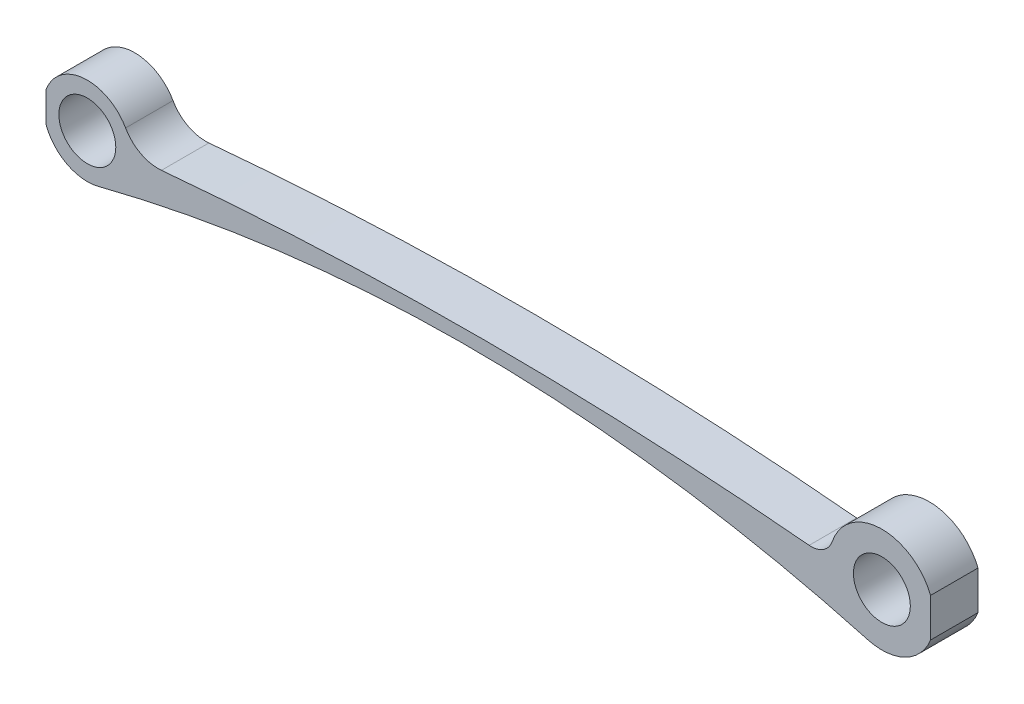
ISO-10303-21;
HEADER;
FILE_DESCRIPTION(('STEP AP214'),'2;1');
FILE_NAME('part.step','',(''),(''),'','','');
FILE_SCHEMA(('AUTOMOTIVE_DESIGN { 1 0 10303 214 1 1 1 1 }'));
ENDSEC;
DATA;
#1=APPLICATION_CONTEXT('core data for automotive mechanical design processes');
#2=APPLICATION_PROTOCOL_DEFINITION('international standard','automotive_design',2000,#1);
#3=PRODUCT_CONTEXT('',#1,'mechanical');
#4=PRODUCT('Part','Part','',(#3));
#5=PRODUCT_RELATED_PRODUCT_CATEGORY('part','',(#4));
#6=PRODUCT_DEFINITION_FORMATION('','',#4);
#7=PRODUCT_DEFINITION_CONTEXT('part definition',#1,'design');
#8=PRODUCT_DEFINITION('design','',#6,#7);
#9=PRODUCT_DEFINITION_SHAPE('','',#8);
#10=(LENGTH_UNIT() NAMED_UNIT(*) SI_UNIT(.MILLI.,.METRE.));
#11=(NAMED_UNIT(*) PLANE_ANGLE_UNIT() SI_UNIT($,.RADIAN.));
#12=(NAMED_UNIT(*) SI_UNIT($,.STERADIAN.) SOLID_ANGLE_UNIT());
#13=UNCERTAINTY_MEASURE_WITH_UNIT(LENGTH_MEASURE(1.E-05),#10,'distance_accuracy_value','');
#14=(GEOMETRIC_REPRESENTATION_CONTEXT(3) GLOBAL_UNCERTAINTY_ASSIGNED_CONTEXT((#13)) GLOBAL_UNIT_ASSIGNED_CONTEXT((#10,
#11,#12)) REPRESENTATION_CONTEXT('',''));
#15=CARTESIAN_POINT('',(0.,0.,0.));
#16=DIRECTION('',(0.,0.,1.));
#17=DIRECTION('',(1.,0.,0.));
#18=AXIS2_PLACEMENT_3D('',#15,#16,#17);
#19=CARTESIAN_POINT('',(20.0774393372365,-78.7302661466852,5.));
#20=DIRECTION('',(0.,0.,1.));
#21=DIRECTION('',(1.,0.,0.));
#22=AXIS2_PLACEMENT_3D('',#19,#20,#21);
#23=PLANE('',#22);
#24=CARTESIAN_POINT('',(0.,0.,5.));
#25=DIRECTION('',(0.,0.,1.));
#26=DIRECTION('',(1.,0.,0.));
#27=AXIS2_PLACEMENT_3D('',#24,#25,#26);
#28=CIRCLE('',#27,3.00000007924961);
#29=CARTESIAN_POINT('',(3.00000007924961,0.,5.));
#30=VERTEX_POINT('',#29);
#31=EDGE_CURVE('E179',#30,#30,#28,.T.);
#32=ORIENTED_EDGE('',*,*,#31,.F.);
#33=EDGE_LOOP('',(#32));
#34=FACE_BOUND('',#33,.T.);
#35=CARTESIAN_POINT('',(83.76241555,0.,5.));
#36=DIRECTION('',(0.,0.,1.));
#37=DIRECTION('',(1.,0.,0.));
#38=AXIS2_PLACEMENT_3D('',#35,#36,#37);
#39=CIRCLE('',#38,3.00000007924962);
#40=CARTESIAN_POINT('',(86.7624156292496,0.,5.));
#41=VERTEX_POINT('',#40);
#42=EDGE_CURVE('E209',#41,#41,#39,.T.);
#43=ORIENTED_EDGE('',*,*,#42,.F.);
#44=EDGE_LOOP('',(#43));
#45=FACE_BOUND('',#44,.T.);
#46=CARTESIAN_POINT('',(0.,0.,5.));
#47=DIRECTION('',(0.,0.,1.));
#48=DIRECTION('',(1.,0.,0.));
#49=AXIS2_PLACEMENT_3D('',#46,#47,#48);
#50=CIRCLE('',#49,4.63518821296482);
#51=CARTESIAN_POINT('',(4.03391514535895,2.28308965431751,5.));
#52=VERTEX_POINT('',#51);
#53=CARTESIAN_POINT('',(-4.35681947691644,1.58211687784739,5.));
#54=VERTEX_POINT('',#53);
#55=EDGE_CURVE('E144',#52,#54,#50,.T.);
#56=ORIENTED_EDGE('',*,*,#55,.T.);
#57=DIRECTION('',(0.,1.,0.));
#58=VECTOR('',#57,1.);
#59=CARTESIAN_POINT('',(-4.35681947691644,0.,5.));
#60=LINE('',#59,#58);
#61=CARTESIAN_POINT('',(-4.35681947691644,-1.58211687784739,5.));
#62=VERTEX_POINT('',#61);
#63=EDGE_CURVE('E114',#62,#54,#60,.T.);
#64=ORIENTED_EDGE('',*,*,#63,.F.);
#65=CARTESIAN_POINT('',(1.14538755959981,-4.49144265330439,5.));
#66=VERTEX_POINT('',#65);
#67=EDGE_CURVE('E164',#62,#66,#50,.T.);
#68=ORIENTED_EDGE('',*,*,#67,.T.);
#69=CARTESIAN_POINT('',(40.1548786744729,-157.46053229337,5.));
#70=DIRECTION('',(0.,0.,-1.));
#71=DIRECTION('',(1.,0.,0.));
#72=AXIS2_PLACEMENT_3D('',#69,#70,#71);
#73=CIRCLE('',#72,157.864761053099);
#74=CARTESIAN_POINT('',(82.2884468660165,-5.32228853526576,5.));
#75=VERTEX_POINT('',#74);
#76=EDGE_CURVE('E132',#66,#75,#73,.T.);
#77=ORIENTED_EDGE('',*,*,#76,.T.);
#78=CARTESIAN_POINT('',(83.76241555,0.,5.));
#79=DIRECTION('',(0.,0.,1.));
#80=DIRECTION('',(1.,0.,0.));
#81=AXIS2_PLACEMENT_3D('',#78,#79,#80);
#82=CIRCLE('',#81,5.5226206581645);
#83=CARTESIAN_POINT('',(88.8955383003181,-2.03725054034898,5.));
#84=VERTEX_POINT('',#83);
#85=EDGE_CURVE('E201',#75,#84,#82,.T.);
#86=ORIENTED_EDGE('',*,*,#85,.T.);
#87=DIRECTION('',(0.,-1.,0.));
#88=VECTOR('',#87,1.);
#89=CARTESIAN_POINT('',(88.8955383003181,0.,5.));
#90=LINE('',#89,#88);
#91=CARTESIAN_POINT('',(88.8955383003181,2.03725054034898,5.));
#92=VERTEX_POINT('',#91);
#93=EDGE_CURVE('E215',#92,#84,#90,.T.);
#94=ORIENTED_EDGE('',*,*,#93,.F.);
#95=CARTESIAN_POINT('',(78.537310201847,1.78818708045004,5.));
#96=VERTEX_POINT('',#95);
#97=EDGE_CURVE('E135',#92,#96,#82,.T.);
#98=ORIENTED_EDGE('',*,*,#97,.T.);
#99=CARTESIAN_POINT('',(76.3123699186025,2.54962808578346,5.));
#100=DIRECTION('',(0.,0.,-1.));
#101=DIRECTION('',(1.,0.,0.));
#102=AXIS2_PLACEMENT_3D('',#99,#100,#101);
#103=CIRCLE('',#102,2.35162745106599);
#104=CARTESIAN_POINT('',(76.0921387205939,0.208335731541776,5.));
#105=VERTEX_POINT('',#104);
#106=EDGE_CURVE('E200',#96,#105,#103,.T.);
#107=ORIENTED_EDGE('',*,*,#106,.T.);
#108=CARTESIAN_POINT('',(41.4374915524002,-368.207498117251,5.));
#109=DIRECTION('',(0.,0.,1.));
#110=DIRECTION('',(1.,0.,0.));
#111=AXIS2_PLACEMENT_3D('',#108,#109,#110);
#112=CIRCLE('',#111,370.042120846875);
#113=CARTESIAN_POINT('',(7.81361057668051,0.303839332472362,5.));
#114=VERTEX_POINT('',#113);
#115=EDGE_CURVE('E171',#105,#114,#112,.T.);
#116=ORIENTED_EDGE('',*,*,#115,.T.);
#117=CARTESIAN_POINT('',(7.45628490178643,4.22006073640343,5.));
#118=DIRECTION('',(0.,0.,-1.));
#119=DIRECTION('',(1.,0.,0.));
#120=AXIS2_PLACEMENT_3D('',#117,#118,#119);
#121=CIRCLE('',#120,3.93248925269305);
#122=EDGE_CURVE('E169',#114,#52,#121,.T.);
#123=ORIENTED_EDGE('',*,*,#122,.T.);
#124=EDGE_LOOP('',(#56,#64,#68,#77,#86,#94,#98,#107,#116,#123));
#125=FACE_BOUND('',#124,.T.);
#126=ADVANCED_FACE('F38',(#34,#45,#125),#23,.T.);
#127=CARTESIAN_POINT('',(20.0774393372365,-78.7302661466852,0.));
#128=DIRECTION('',(0.,0.,1.));
#129=DIRECTION('',(1.,0.,0.));
#130=AXIS2_PLACEMENT_3D('',#127,#128,#129);
#131=PLANE('',#130);
#132=CARTESIAN_POINT('',(0.,0.,0.));
#133=DIRECTION('',(0.,0.,1.));
#134=DIRECTION('',(1.,0.,0.));
#135=AXIS2_PLACEMENT_3D('',#132,#133,#134);
#136=CIRCLE('',#135,3.00000007924961);
#137=CARTESIAN_POINT('',(3.00000007924961,0.,0.));
#138=VERTEX_POINT('',#137);
#139=EDGE_CURVE('E206',#138,#138,#136,.T.);
#140=ORIENTED_EDGE('',*,*,#139,.T.);
#141=EDGE_LOOP('',(#140));
#142=FACE_BOUND('',#141,.T.);
#143=CARTESIAN_POINT('',(83.76241555,0.,0.));
#144=DIRECTION('',(0.,0.,1.));
#145=DIRECTION('',(1.,0.,0.));
#146=AXIS2_PLACEMENT_3D('',#143,#144,#145);
#147=CIRCLE('',#146,3.00000007924962);
#148=CARTESIAN_POINT('',(86.7624156292496,0.,0.));
#149=VERTEX_POINT('',#148);
#150=EDGE_CURVE('E212',#149,#149,#147,.T.);
#151=ORIENTED_EDGE('',*,*,#150,.T.);
#152=EDGE_LOOP('',(#151));
#153=FACE_BOUND('',#152,.T.);
#154=DIRECTION('',(0.,1.,0.));
#155=VECTOR('',#154,1.);
#156=CARTESIAN_POINT('',(-4.35681947691644,0.,0.));
#157=LINE('',#156,#155);
#158=CARTESIAN_POINT('',(-4.35681947691644,-1.58211687784739,0.));
#159=VERTEX_POINT('',#158);
#160=CARTESIAN_POINT('',(-4.35681947691644,1.58211687784739,0.));
#161=VERTEX_POINT('',#160);
#162=EDGE_CURVE('E52',#159,#161,#157,.T.);
#163=ORIENTED_EDGE('',*,*,#162,.T.);
#164=CARTESIAN_POINT('',(0.,0.,0.));
#165=DIRECTION('',(0.,0.,1.));
#166=DIRECTION('',(1.,0.,0.));
#167=AXIS2_PLACEMENT_3D('',#164,#165,#166);
#168=CIRCLE('',#167,4.63518821296482);
#169=CARTESIAN_POINT('',(4.03391514535895,2.28308965431751,0.));
#170=VERTEX_POINT('',#169);
#171=EDGE_CURVE('E124',#170,#161,#168,.T.);
#172=ORIENTED_EDGE('',*,*,#171,.F.);
#173=CARTESIAN_POINT('',(7.45628490178643,4.22006073640343,0.));
#174=DIRECTION('',(0.,0.,-1.));
#175=DIRECTION('',(1.,0.,0.));
#176=AXIS2_PLACEMENT_3D('',#173,#174,#175);
#177=CIRCLE('',#176,3.93248925269305);
#178=CARTESIAN_POINT('',(7.81361057668051,0.303839332472362,0.));
#179=VERTEX_POINT('',#178);
#180=EDGE_CURVE('E137',#179,#170,#177,.T.);
#181=ORIENTED_EDGE('',*,*,#180,.F.);
#182=CARTESIAN_POINT('',(41.4374915524002,-368.207498117251,0.));
#183=DIRECTION('',(0.,0.,1.));
#184=DIRECTION('',(1.,0.,0.));
#185=AXIS2_PLACEMENT_3D('',#182,#183,#184);
#186=CIRCLE('',#185,370.042120846875);
#187=CARTESIAN_POINT('',(76.0921387205939,0.208335731541776,0.));
#188=VERTEX_POINT('',#187);
#189=EDGE_CURVE('E184',#188,#179,#186,.T.);
#190=ORIENTED_EDGE('',*,*,#189,.F.);
#191=CARTESIAN_POINT('',(76.3123699186025,2.54962808578346,0.));
#192=DIRECTION('',(0.,0.,-1.));
#193=DIRECTION('',(1.,0.,0.));
#194=AXIS2_PLACEMENT_3D('',#191,#192,#193);
#195=CIRCLE('',#194,2.35162745106599);
#196=CARTESIAN_POINT('',(78.537310201847,1.78818708045004,0.));
#197=VERTEX_POINT('',#196);
#198=EDGE_CURVE('E183',#197,#188,#195,.T.);
#199=ORIENTED_EDGE('',*,*,#198,.F.);
#200=CARTESIAN_POINT('',(83.76241555,0.,0.));
#201=DIRECTION('',(0.,0.,1.));
#202=DIRECTION('',(1.,0.,0.));
#203=AXIS2_PLACEMENT_3D('',#200,#201,#202);
#204=CIRCLE('',#203,5.5226206581645);
#205=CARTESIAN_POINT('',(88.8955383003181,2.03725054034898,0.));
#206=VERTEX_POINT('',#205);
#207=EDGE_CURVE('E178',#206,#197,#204,.T.);
#208=ORIENTED_EDGE('',*,*,#207,.F.);
#209=DIRECTION('',(0.,-1.,0.));
#210=VECTOR('',#209,1.);
#211=CARTESIAN_POINT('',(88.8955383003181,0.,0.));
#212=LINE('',#211,#210);
#213=CARTESIAN_POINT('',(88.8955383003181,-2.03725054034898,0.));
#214=VERTEX_POINT('',#213);
#215=EDGE_CURVE('E60',#206,#214,#212,.T.);
#216=ORIENTED_EDGE('',*,*,#215,.T.);
#217=CARTESIAN_POINT('',(82.2884468660165,-5.32228853526576,0.));
#218=VERTEX_POINT('',#217);
#219=EDGE_CURVE('E180',#218,#214,#204,.T.);
#220=ORIENTED_EDGE('',*,*,#219,.F.);
#221=CARTESIAN_POINT('',(40.1548786744729,-157.46053229337,0.));
#222=DIRECTION('',(0.,0.,-1.));
#223=DIRECTION('',(1.,0.,0.));
#224=AXIS2_PLACEMENT_3D('',#221,#222,#223);
#225=CIRCLE('',#224,157.864761053099);
#226=CARTESIAN_POINT('',(1.14538755959981,-4.49144265330439,0.));
#227=VERTEX_POINT('',#226);
#228=EDGE_CURVE('E175',#227,#218,#225,.T.);
#229=ORIENTED_EDGE('',*,*,#228,.F.);
#230=EDGE_CURVE('E126',#159,#227,#168,.T.);
#231=ORIENTED_EDGE('',*,*,#230,.F.);
#232=EDGE_LOOP('',(#163,#172,#181,#190,#199,#208,#216,#220,#229,#231));
#233=FACE_BOUND('',#232,.T.);
#234=ADVANCED_FACE('F122',(#142,#153,#233),#131,.F.);
#235=CARTESIAN_POINT('',(0.,0.,5.));
#236=DIRECTION('',(0.,0.,-1.));
#237=DIRECTION('',(-1.,0.,0.));
#238=AXIS2_PLACEMENT_3D('',#235,#236,#237);
#239=CYLINDRICAL_SURFACE('',#238,4.63518821296482);
#240=DIRECTION('',(0.,0.,-1.));
#241=VECTOR('',#240,1.);
#242=CARTESIAN_POINT('',(-4.35681947691644,1.58211687784739,5.));
#243=LINE('',#242,#241);
#244=EDGE_CURVE('E11',#54,#161,#243,.T.);
#245=ORIENTED_EDGE('',*,*,#244,.F.);
#246=ORIENTED_EDGE('',*,*,#55,.F.);
#247=DIRECTION('',(0.,0.,-1.));
#248=VECTOR('',#247,1.);
#249=CARTESIAN_POINT('',(4.03391514535895,2.28308965431751,5.));
#250=LINE('',#249,#248);
#251=EDGE_CURVE('E131',#52,#170,#250,.T.);
#252=ORIENTED_EDGE('',*,*,#251,.T.);
#253=ORIENTED_EDGE('',*,*,#171,.T.);
#254=EDGE_LOOP('',(#245,#246,#252,#253));
#255=FACE_BOUND('',#254,.T.);
#256=ADVANCED_FACE('F129',(#255),#239,.T.);
#257=DIRECTION('',(0.,0.,-1.));
#258=VECTOR('',#257,1.);
#259=CARTESIAN_POINT('',(-4.35681947691644,-1.58211687784739,5.));
#260=LINE('',#259,#258);
#261=EDGE_CURVE('E46',#159,#62,#260,.F.);
#262=ORIENTED_EDGE('',*,*,#261,.F.);
#263=ORIENTED_EDGE('',*,*,#230,.T.);
#264=DIRECTION('',(0.,0.,-1.));
#265=VECTOR('',#264,1.);
#266=CARTESIAN_POINT('',(1.14538755959981,-4.49144265330439,5.));
#267=LINE('',#266,#265);
#268=EDGE_CURVE('E141',#66,#227,#267,.T.);
#269=ORIENTED_EDGE('',*,*,#268,.F.);
#270=ORIENTED_EDGE('',*,*,#67,.F.);
#271=EDGE_LOOP('',(#262,#263,#269,#270));
#272=FACE_BOUND('',#271,.T.);
#273=ADVANCED_FACE('F167',(#272),#239,.T.);
#274=CARTESIAN_POINT('',(83.76241555,0.,5.));
#275=DIRECTION('',(0.,0.,-1.));
#276=DIRECTION('',(-1.,0.,0.));
#277=AXIS2_PLACEMENT_3D('',#274,#275,#276);
#278=CYLINDRICAL_SURFACE('',#277,5.5226206581645);
#279=DIRECTION('',(0.,0.,-1.));
#280=VECTOR('',#279,1.);
#281=CARTESIAN_POINT('',(88.8955383003181,-2.03725054034898,5.));
#282=LINE('',#281,#280);
#283=EDGE_CURVE('E160',#84,#214,#282,.T.);
#284=ORIENTED_EDGE('',*,*,#283,.F.);
#285=ORIENTED_EDGE('',*,*,#85,.F.);
#286=DIRECTION('',(0.,0.,-1.));
#287=VECTOR('',#286,1.);
#288=CARTESIAN_POINT('',(82.2884468660165,-5.32228853526576,5.));
#289=LINE('',#288,#287);
#290=EDGE_CURVE('E155',#75,#218,#289,.T.);
#291=ORIENTED_EDGE('',*,*,#290,.T.);
#292=ORIENTED_EDGE('',*,*,#219,.T.);
#293=EDGE_LOOP('',(#284,#285,#291,#292));
#294=FACE_BOUND('',#293,.T.);
#295=ADVANCED_FACE('F224',(#294),#278,.T.);
#296=DIRECTION('',(0.,0.,-1.));
#297=VECTOR('',#296,1.);
#298=CARTESIAN_POINT('',(88.8955383003181,2.03725054034898,5.));
#299=LINE('',#298,#297);
#300=EDGE_CURVE('E158',#206,#92,#299,.F.);
#301=ORIENTED_EDGE('',*,*,#300,.F.);
#302=ORIENTED_EDGE('',*,*,#207,.T.);
#303=DIRECTION('',(0.,0.,-1.));
#304=VECTOR('',#303,1.);
#305=CARTESIAN_POINT('',(78.537310201847,1.78818708045004,5.));
#306=LINE('',#305,#304);
#307=EDGE_CURVE('E152',#96,#197,#306,.T.);
#308=ORIENTED_EDGE('',*,*,#307,.F.);
#309=ORIENTED_EDGE('',*,*,#97,.F.);
#310=EDGE_LOOP('',(#301,#302,#308,#309));
#311=FACE_BOUND('',#310,.T.);
#312=ADVANCED_FACE('F228',(#311),#278,.T.);
#313=CARTESIAN_POINT('',(40.1548786744729,-157.46053229337,5.));
#314=DIRECTION('',(0.,0.,-1.));
#315=DIRECTION('',(-1.,0.,0.));
#316=AXIS2_PLACEMENT_3D('',#313,#314,#315);
#317=CYLINDRICAL_SURFACE('',#316,157.864761053099);
#318=ORIENTED_EDGE('',*,*,#228,.T.);
#319=ORIENTED_EDGE('',*,*,#290,.F.);
#320=ORIENTED_EDGE('',*,*,#76,.F.);
#321=ORIENTED_EDGE('',*,*,#268,.T.);
#322=EDGE_LOOP('',(#318,#319,#320,#321));
#323=FACE_BOUND('',#322,.T.);
#324=ADVANCED_FACE('F40',(#323),#317,.F.);
#325=CARTESIAN_POINT('',(76.3123699186025,2.54962808578346,5.));
#326=DIRECTION('',(0.,0.,-1.));
#327=DIRECTION('',(-1.,0.,0.));
#328=AXIS2_PLACEMENT_3D('',#325,#326,#327);
#329=CYLINDRICAL_SURFACE('',#328,2.35162745106599);
#330=ORIENTED_EDGE('',*,*,#198,.T.);
#331=DIRECTION('',(0.,0.,-1.));
#332=VECTOR('',#331,1.);
#333=CARTESIAN_POINT('',(76.0921387205939,0.208335731541776,5.));
#334=LINE('',#333,#332);
#335=EDGE_CURVE('E149',#105,#188,#334,.T.);
#336=ORIENTED_EDGE('',*,*,#335,.F.);
#337=ORIENTED_EDGE('',*,*,#106,.F.);
#338=ORIENTED_EDGE('',*,*,#307,.T.);
#339=EDGE_LOOP('',(#330,#336,#337,#338));
#340=FACE_BOUND('',#339,.T.);
#341=ADVANCED_FACE('F195',(#340),#329,.F.);
#342=CARTESIAN_POINT('',(41.4374915524002,-368.207498117251,5.));
#343=DIRECTION('',(0.,0.,-1.));
#344=DIRECTION('',(-1.,0.,0.));
#345=AXIS2_PLACEMENT_3D('',#342,#343,#344);
#346=CYLINDRICAL_SURFACE('',#345,370.042120846875);
#347=ORIENTED_EDGE('',*,*,#189,.T.);
#348=DIRECTION('',(0.,0.,-1.));
#349=VECTOR('',#348,1.);
#350=CARTESIAN_POINT('',(7.81361057668051,0.303839332472362,5.));
#351=LINE('',#350,#349);
#352=EDGE_CURVE('E146',#114,#179,#351,.T.);
#353=ORIENTED_EDGE('',*,*,#352,.F.);
#354=ORIENTED_EDGE('',*,*,#115,.F.);
#355=ORIENTED_EDGE('',*,*,#335,.T.);
#356=EDGE_LOOP('',(#347,#353,#354,#355));
#357=FACE_BOUND('',#356,.T.);
#358=ADVANCED_FACE('F199',(#357),#346,.T.);
#359=CARTESIAN_POINT('',(7.45628490178643,4.22006073640343,5.));
#360=DIRECTION('',(0.,0.,-1.));
#361=DIRECTION('',(-1.,0.,0.));
#362=AXIS2_PLACEMENT_3D('',#359,#360,#361);
#363=CYLINDRICAL_SURFACE('',#362,3.93248925269305);
#364=ORIENTED_EDGE('',*,*,#180,.T.);
#365=ORIENTED_EDGE('',*,*,#251,.F.);
#366=ORIENTED_EDGE('',*,*,#122,.F.);
#367=ORIENTED_EDGE('',*,*,#352,.T.);
#368=EDGE_LOOP('',(#364,#365,#366,#367));
#369=FACE_BOUND('',#368,.T.);
#370=ADVANCED_FACE('F189',(#369),#363,.F.);
#371=CARTESIAN_POINT('',(0.,0.,5.));
#372=DIRECTION('',(0.,0.,-1.));
#373=DIRECTION('',(-1.,0.,0.));
#374=AXIS2_PLACEMENT_3D('',#371,#372,#373);
#375=CYLINDRICAL_SURFACE('',#374,3.00000007924961);
#376=ORIENTED_EDGE('',*,*,#31,.T.);
#377=EDGE_LOOP('',(#376));
#378=FACE_BOUND('',#377,.T.);
#379=ORIENTED_EDGE('',*,*,#139,.F.);
#380=EDGE_LOOP('',(#379));
#381=FACE_BOUND('',#380,.T.);
#382=ADVANCED_FACE('F246',(#378,#381),#375,.F.);
#383=CARTESIAN_POINT('',(83.76241555,0.,5.));
#384=DIRECTION('',(0.,0.,-1.));
#385=DIRECTION('',(-1.,0.,0.));
#386=AXIS2_PLACEMENT_3D('',#383,#384,#385);
#387=CYLINDRICAL_SURFACE('',#386,3.00000007924962);
#388=ORIENTED_EDGE('',*,*,#42,.T.);
#389=EDGE_LOOP('',(#388));
#390=FACE_BOUND('',#389,.T.);
#391=ORIENTED_EDGE('',*,*,#150,.F.);
#392=EDGE_LOOP('',(#391));
#393=FACE_BOUND('',#392,.T.);
#394=ADVANCED_FACE('F278',(#390,#393),#387,.F.);
#395=CARTESIAN_POINT('',(88.8955383003181,0.,5.));
#396=DIRECTION('',(1.,0.,0.));
#397=DIRECTION('',(0.,0.,-1.));
#398=AXIS2_PLACEMENT_3D('',#395,#396,#397);
#399=PLANE('',#398);
#400=ORIENTED_EDGE('',*,*,#283,.T.);
#401=ORIENTED_EDGE('',*,*,#215,.F.);
#402=ORIENTED_EDGE('',*,*,#300,.T.);
#403=ORIENTED_EDGE('',*,*,#93,.T.);
#404=EDGE_LOOP('',(#400,#401,#402,#403));
#405=FACE_BOUND('',#404,.T.);
#406=ADVANCED_FACE('F221',(#405),#399,.T.);
#407=CARTESIAN_POINT('',(-4.35681947691644,0.,5.));
#408=DIRECTION('',(-1.,0.,0.));
#409=DIRECTION('',(0.,0.,1.));
#410=AXIS2_PLACEMENT_3D('',#407,#408,#409);
#411=PLANE('',#410);
#412=ORIENTED_EDGE('',*,*,#244,.T.);
#413=ORIENTED_EDGE('',*,*,#162,.F.);
#414=ORIENTED_EDGE('',*,*,#261,.T.);
#415=ORIENTED_EDGE('',*,*,#63,.T.);
#416=EDGE_LOOP('',(#412,#413,#414,#415));
#417=FACE_BOUND('',#416,.T.);
#418=ADVANCED_FACE('F112',(#417),#411,.T.);
#419=CLOSED_SHELL('',(#126,#234,#256,#273,#295,#312,#324,#341,#358,#370,#382,#394,#406,#418));
#420=MANIFOLD_SOLID_BREP('B2',#419);
#421=ADVANCED_BREP_SHAPE_REPRESENTATION('',(#18,#420),#14);
#422=SHAPE_DEFINITION_REPRESENTATION(#9,#421);
ENDSEC;
END-ISO-10303-21;
